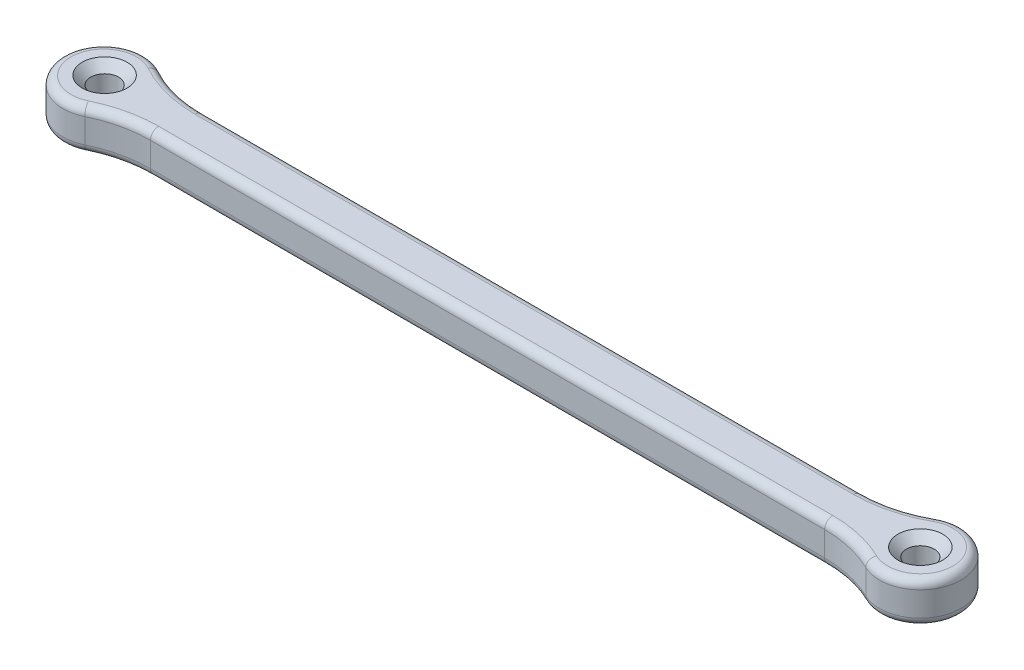
ISO-10303-21;
HEADER;
FILE_DESCRIPTION(('STEP AP214'),'2;1');
FILE_NAME('part.step','',(''),(''),'','','');
FILE_SCHEMA(('AUTOMOTIVE_DESIGN { 1 0 10303 214 1 1 1 1 }'));
ENDSEC;
DATA;
#1=APPLICATION_CONTEXT('core data for automotive mechanical design processes');
#2=APPLICATION_PROTOCOL_DEFINITION('international standard','automotive_design',2000,#1);
#3=PRODUCT_CONTEXT('',#1,'mechanical');
#4=PRODUCT('Part','Part','',(#3));
#5=PRODUCT_RELATED_PRODUCT_CATEGORY('part','',(#4));
#6=PRODUCT_DEFINITION_FORMATION('','',#4);
#7=PRODUCT_DEFINITION_CONTEXT('part definition',#1,'design');
#8=PRODUCT_DEFINITION('design','',#6,#7);
#9=PRODUCT_DEFINITION_SHAPE('','',#8);
#10=(LENGTH_UNIT() NAMED_UNIT(*) SI_UNIT(.MILLI.,.METRE.));
#11=(NAMED_UNIT(*) PLANE_ANGLE_UNIT() SI_UNIT($,.RADIAN.));
#12=(NAMED_UNIT(*) SI_UNIT($,.STERADIAN.) SOLID_ANGLE_UNIT());
#13=UNCERTAINTY_MEASURE_WITH_UNIT(LENGTH_MEASURE(1.E-05),#10,'distance_accuracy_value','');
#14=(GEOMETRIC_REPRESENTATION_CONTEXT(3) GLOBAL_UNCERTAINTY_ASSIGNED_CONTEXT((#13)) GLOBAL_UNIT_ASSIGNED_CONTEXT((#10,
#11,#12)) REPRESENTATION_CONTEXT('',''));
#15=CARTESIAN_POINT('',(0.,0.,0.));
#16=DIRECTION('',(0.,0.,1.));
#17=DIRECTION('',(1.,0.,0.));
#18=AXIS2_PLACEMENT_3D('',#15,#16,#17);
#19=CARTESIAN_POINT('',(90.3175416344814,5.,-17.5));
#20=DIRECTION('',(0.,-1.,0.));
#21=DIRECTION('',(0.,0.,-1.));
#22=AXIS2_PLACEMENT_3D('',#19,#20,#21);
#23=CYLINDRICAL_SURFACE('',#22,15.);
#24=DIRECTION('',(0.,-1.,0.));
#25=VECTOR('',#24,1.);
#26=CARTESIAN_POINT('',(97.5793854086204,5.,-4.37500000000002));
#27=LINE('',#26,#25);
#28=CARTESIAN_POINT('',(97.5793854086204,4.,-4.37500000000002));
#29=VERTEX_POINT('',#28);
#30=CARTESIAN_POINT('',(97.5793854086204,1.,-4.37500000000002));
#31=VERTEX_POINT('',#30);
#32=EDGE_CURVE('E155',#29,#31,#27,.T.);
#33=ORIENTED_EDGE('',*,*,#32,.T.);
#34=CARTESIAN_POINT('',(90.3175416344814,1.,-17.5));
#35=DIRECTION('',(0.,1.,0.));
#36=DIRECTION('',(0.,0.,1.));
#37=AXIS2_PLACEMENT_3D('',#34,#35,#36);
#38=CIRCLE('',#37,15.);
#39=CARTESIAN_POINT('',(90.3175416344814,1.,-2.5));
#40=VERTEX_POINT('',#39);
#41=EDGE_CURVE('E45',#31,#40,#38,.F.);
#42=ORIENTED_EDGE('',*,*,#41,.T.);
#43=DIRECTION('',(0.,-1.,0.));
#44=VECTOR('',#43,1.);
#45=CARTESIAN_POINT('',(90.3175416344814,5.,-2.5));
#46=LINE('',#45,#44);
#47=CARTESIAN_POINT('',(90.3175416344814,4.,-2.5));
#48=VERTEX_POINT('',#47);
#49=EDGE_CURVE('E188',#48,#40,#46,.T.);
#50=ORIENTED_EDGE('',*,*,#49,.F.);
#51=CARTESIAN_POINT('',(90.3175416344814,4.,-17.5));
#52=DIRECTION('',(0.,1.,0.));
#53=DIRECTION('',(0.,0.,1.));
#54=AXIS2_PLACEMENT_3D('',#51,#52,#53);
#55=CIRCLE('',#54,15.);
#56=EDGE_CURVE('E160',#48,#29,#55,.T.);
#57=ORIENTED_EDGE('',*,*,#56,.T.);
#58=EDGE_LOOP('',(#33,#42,#50,#57));
#59=FACE_BOUND('',#58,.T.);
#60=ADVANCED_FACE('F36',(#59),#23,.F.);
#61=CARTESIAN_POINT('',(9.68245836551854,5.,-2.5));
#62=DIRECTION('',(0.,0.,-1.));
#63=DIRECTION('',(-1.,0.,0.));
#64=AXIS2_PLACEMENT_3D('',#61,#62,#63);
#65=PLANE('',#64);
#66=ORIENTED_EDGE('',*,*,#49,.T.);
#67=DIRECTION('',(1.,0.,0.));
#68=VECTOR('',#67,1.);
#69=CARTESIAN_POINT('',(9.68245836551854,1.,-2.5));
#70=LINE('',#69,#68);
#71=CARTESIAN_POINT('',(9.68245836551854,1.,-2.5));
#72=VERTEX_POINT('',#71);
#73=EDGE_CURVE('E11',#40,#72,#70,.F.);
#74=ORIENTED_EDGE('',*,*,#73,.T.);
#75=DIRECTION('',(0.,-1.,0.));
#76=VECTOR('',#75,1.);
#77=CARTESIAN_POINT('',(9.68245836551854,5.,-2.5));
#78=LINE('',#77,#76);
#79=CARTESIAN_POINT('',(9.68245836551854,4.,-2.5));
#80=VERTEX_POINT('',#79);
#81=EDGE_CURVE('E192',#80,#72,#78,.T.);
#82=ORIENTED_EDGE('',*,*,#81,.F.);
#83=DIRECTION('',(1.,0.,0.));
#84=VECTOR('',#83,1.);
#85=CARTESIAN_POINT('',(9.68245836551854,4.,-2.5));
#86=LINE('',#85,#84);
#87=EDGE_CURVE('E208',#80,#48,#86,.T.);
#88=ORIENTED_EDGE('',*,*,#87,.T.);
#89=EDGE_LOOP('',(#66,#74,#82,#88));
#90=FACE_BOUND('',#89,.T.);
#91=ADVANCED_FACE('F307',(#90),#65,.T.);
#92=CARTESIAN_POINT('',(9.68245836551854,5.,-17.5));
#93=DIRECTION('',(0.,-1.,0.));
#94=DIRECTION('',(0.,0.,-1.));
#95=AXIS2_PLACEMENT_3D('',#92,#93,#94);
#96=CYLINDRICAL_SURFACE('',#95,15.);
#97=ORIENTED_EDGE('',*,*,#81,.T.);
#98=CARTESIAN_POINT('',(9.68245836551854,1.,-17.5));
#99=DIRECTION('',(0.,1.,0.));
#100=DIRECTION('',(0.,0.,1.));
#101=AXIS2_PLACEMENT_3D('',#98,#99,#100);
#102=CIRCLE('',#101,15.);
#103=CARTESIAN_POINT('',(2.42061459137963,1.,-4.37500000000001));
#104=VERTEX_POINT('',#103);
#105=EDGE_CURVE('E252',#72,#104,#102,.F.);
#106=ORIENTED_EDGE('',*,*,#105,.T.);
#107=DIRECTION('',(0.,-1.,0.));
#108=VECTOR('',#107,1.);
#109=CARTESIAN_POINT('',(2.42061459137963,5.,-4.37500000000001));
#110=LINE('',#109,#108);
#111=CARTESIAN_POINT('',(2.42061459137963,4.,-4.37500000000001));
#112=VERTEX_POINT('',#111);
#113=EDGE_CURVE('E315',#112,#104,#110,.T.);
#114=ORIENTED_EDGE('',*,*,#113,.F.);
#115=CARTESIAN_POINT('',(9.68245836551854,4.,-17.5));
#116=DIRECTION('',(0.,1.,0.));
#117=DIRECTION('',(0.,0.,1.));
#118=AXIS2_PLACEMENT_3D('',#115,#116,#117);
#119=CIRCLE('',#118,15.);
#120=EDGE_CURVE('E210',#112,#80,#119,.T.);
#121=ORIENTED_EDGE('',*,*,#120,.T.);
#122=EDGE_LOOP('',(#97,#106,#114,#121));
#123=FACE_BOUND('',#122,.T.);
#124=ADVANCED_FACE('F311',(#123),#96,.F.);
#125=CARTESIAN_POINT('',(0.,5.,0.));
#126=DIRECTION('',(0.,-1.,0.));
#127=DIRECTION('',(0.,0.,-1.));
#128=AXIS2_PLACEMENT_3D('',#125,#126,#127);
#129=CYLINDRICAL_SURFACE('',#128,5.);
#130=ORIENTED_EDGE('',*,*,#113,.T.);
#131=CARTESIAN_POINT('',(0.,1.,0.));
#132=DIRECTION('',(0.,1.,0.));
#133=DIRECTION('',(0.,0.,1.));
#134=AXIS2_PLACEMENT_3D('',#131,#132,#133);
#135=CIRCLE('',#134,5.);
#136=CARTESIAN_POINT('',(2.17944947177033,1.,4.5));
#137=VERTEX_POINT('',#136);
#138=EDGE_CURVE('E255',#104,#137,#135,.T.);
#139=ORIENTED_EDGE('',*,*,#138,.T.);
#140=DIRECTION('',(0.,-1.,0.));
#141=VECTOR('',#140,1.);
#142=CARTESIAN_POINT('',(2.17944947177033,5.,4.5));
#143=LINE('',#142,#141);
#144=CARTESIAN_POINT('',(2.17944947177033,4.,4.5));
#145=VERTEX_POINT('',#144);
#146=EDGE_CURVE('E330',#145,#137,#143,.T.);
#147=ORIENTED_EDGE('',*,*,#146,.F.);
#148=CARTESIAN_POINT('',(0.,4.,0.));
#149=DIRECTION('',(0.,1.,0.));
#150=DIRECTION('',(0.,0.,1.));
#151=AXIS2_PLACEMENT_3D('',#148,#149,#150);
#152=CIRCLE('',#151,5.);
#153=EDGE_CURVE('E212',#145,#112,#152,.F.);
#154=ORIENTED_EDGE('',*,*,#153,.T.);
#155=EDGE_LOOP('',(#130,#139,#147,#154));
#156=FACE_BOUND('',#155,.T.);
#157=ADVANCED_FACE('F329',(#156),#129,.T.);
#158=CARTESIAN_POINT('',(8.71779788708135,5.,18.));
#159=DIRECTION('',(0.,-1.,0.));
#160=DIRECTION('',(0.,0.,-1.));
#161=AXIS2_PLACEMENT_3D('',#158,#159,#160);
#162=CYLINDRICAL_SURFACE('',#161,15.);
#163=ORIENTED_EDGE('',*,*,#146,.T.);
#164=CARTESIAN_POINT('',(8.71779788708135,1.,18.));
#165=DIRECTION('',(0.,1.,0.));
#166=DIRECTION('',(0.,0.,1.));
#167=AXIS2_PLACEMENT_3D('',#164,#165,#166);
#168=CIRCLE('',#167,15.);
#169=CARTESIAN_POINT('',(8.71779788708135,1.,3.));
#170=VERTEX_POINT('',#169);
#171=EDGE_CURVE('E257',#137,#170,#168,.F.);
#172=ORIENTED_EDGE('',*,*,#171,.T.);
#173=DIRECTION('',(0.,-1.,0.));
#174=VECTOR('',#173,1.);
#175=CARTESIAN_POINT('',(8.71779788708135,5.,3.));
#176=LINE('',#175,#174);
#177=CARTESIAN_POINT('',(8.71779788708135,4.,3.));
#178=VERTEX_POINT('',#177);
#179=EDGE_CURVE('E338',#178,#170,#176,.T.);
#180=ORIENTED_EDGE('',*,*,#179,.F.);
#181=CARTESIAN_POINT('',(8.71779788708135,4.,18.));
#182=DIRECTION('',(0.,1.,0.));
#183=DIRECTION('',(0.,0.,1.));
#184=AXIS2_PLACEMENT_3D('',#181,#182,#183);
#185=CIRCLE('',#184,15.);
#186=EDGE_CURVE('E214',#178,#145,#185,.T.);
#187=ORIENTED_EDGE('',*,*,#186,.T.);
#188=EDGE_LOOP('',(#163,#172,#180,#187));
#189=FACE_BOUND('',#188,.T.);
#190=ADVANCED_FACE('F334',(#189),#162,.F.);
#191=CARTESIAN_POINT('',(91.2822021129186,5.,3.));
#192=DIRECTION('',(0.,0.,1.));
#193=DIRECTION('',(1.,0.,0.));
#194=AXIS2_PLACEMENT_3D('',#191,#192,#193);
#195=PLANE('',#194);
#196=ORIENTED_EDGE('',*,*,#179,.T.);
#197=DIRECTION('',(-1.,0.,0.));
#198=VECTOR('',#197,1.);
#199=CARTESIAN_POINT('',(91.2822021129186,1.,3.));
#200=LINE('',#199,#198);
#201=CARTESIAN_POINT('',(91.2822021129186,1.,3.));
#202=VERTEX_POINT('',#201);
#203=EDGE_CURVE('E259',#170,#202,#200,.F.);
#204=ORIENTED_EDGE('',*,*,#203,.T.);
#205=DIRECTION('',(0.,-1.,0.));
#206=VECTOR('',#205,1.);
#207=CARTESIAN_POINT('',(91.2822021129186,5.,3.));
#208=LINE('',#207,#206);
#209=CARTESIAN_POINT('',(91.2822021129186,4.,3.));
#210=VERTEX_POINT('',#209);
#211=EDGE_CURVE('E172',#210,#202,#208,.T.);
#212=ORIENTED_EDGE('',*,*,#211,.F.);
#213=DIRECTION('',(-1.,0.,0.));
#214=VECTOR('',#213,1.);
#215=CARTESIAN_POINT('',(91.2822021129186,4.,3.));
#216=LINE('',#215,#214);
#217=EDGE_CURVE('E216',#210,#178,#216,.T.);
#218=ORIENTED_EDGE('',*,*,#217,.T.);
#219=EDGE_LOOP('',(#196,#204,#212,#218));
#220=FACE_BOUND('',#219,.T.);
#221=ADVANCED_FACE('F429',(#220),#195,.T.);
#222=CARTESIAN_POINT('',(91.2822021129186,5.,18.));
#223=DIRECTION('',(0.,-1.,0.));
#224=DIRECTION('',(0.,0.,-1.));
#225=AXIS2_PLACEMENT_3D('',#222,#223,#224);
#226=CYLINDRICAL_SURFACE('',#225,15.);
#227=ORIENTED_EDGE('',*,*,#211,.T.);
#228=CARTESIAN_POINT('',(91.2822021129186,1.,18.));
#229=DIRECTION('',(0.,1.,0.));
#230=DIRECTION('',(0.,0.,1.));
#231=AXIS2_PLACEMENT_3D('',#228,#229,#230);
#232=CIRCLE('',#231,15.);
#233=CARTESIAN_POINT('',(97.8205505282296,1.,4.5));
#234=VERTEX_POINT('',#233);
#235=EDGE_CURVE('E171',#202,#234,#232,.F.);
#236=ORIENTED_EDGE('',*,*,#235,.T.);
#237=DIRECTION('',(0.,-1.,0.));
#238=VECTOR('',#237,1.);
#239=CARTESIAN_POINT('',(97.8205505282296,5.,4.5));
#240=LINE('',#239,#238);
#241=CARTESIAN_POINT('',(97.8205505282296,4.,4.5));
#242=VERTEX_POINT('',#241);
#243=EDGE_CURVE('E153',#242,#234,#240,.T.);
#244=ORIENTED_EDGE('',*,*,#243,.F.);
#245=CARTESIAN_POINT('',(91.2822021129186,4.,18.));
#246=DIRECTION('',(0.,1.,0.));
#247=DIRECTION('',(0.,0.,1.));
#248=AXIS2_PLACEMENT_3D('',#245,#246,#247);
#249=CIRCLE('',#248,15.);
#250=EDGE_CURVE('E168',#242,#210,#249,.T.);
#251=ORIENTED_EDGE('',*,*,#250,.T.);
#252=EDGE_LOOP('',(#227,#236,#244,#251));
#253=FACE_BOUND('',#252,.T.);
#254=ADVANCED_FACE('F166',(#253),#226,.F.);
#255=CARTESIAN_POINT('',(100.,5.,0.));
#256=DIRECTION('',(0.,-1.,0.));
#257=DIRECTION('',(0.,0.,-1.));
#258=AXIS2_PLACEMENT_3D('',#255,#256,#257);
#259=CYLINDRICAL_SURFACE('',#258,5.00000000000001);
#260=ORIENTED_EDGE('',*,*,#243,.T.);
#261=CARTESIAN_POINT('',(100.,1.,0.));
#262=DIRECTION('',(0.,1.,0.));
#263=DIRECTION('',(0.,0.,1.));
#264=AXIS2_PLACEMENT_3D('',#261,#262,#263);
#265=CIRCLE('',#264,5.00000000000001);
#266=EDGE_CURVE('E60',#234,#31,#265,.T.);
#267=ORIENTED_EDGE('',*,*,#266,.T.);
#268=ORIENTED_EDGE('',*,*,#32,.F.);
#269=CARTESIAN_POINT('',(100.,4.,0.));
#270=DIRECTION('',(0.,1.,0.));
#271=DIRECTION('',(0.,0.,1.));
#272=AXIS2_PLACEMENT_3D('',#269,#270,#271);
#273=CIRCLE('',#272,5.00000000000001);
#274=EDGE_CURVE('E150',#29,#242,#273,.F.);
#275=ORIENTED_EDGE('',*,*,#274,.T.);
#276=EDGE_LOOP('',(#260,#267,#268,#275));
#277=FACE_BOUND('',#276,.T.);
#278=ADVANCED_FACE('F152',(#277),#259,.T.);
#279=CARTESIAN_POINT('',(90.3175416344814,5.,-17.5));
#280=DIRECTION('',(0.,1.,0.));
#281=DIRECTION('',(0.,0.,1.));
#282=AXIS2_PLACEMENT_3D('',#279,#280,#281);
#283=PLANE('',#282);
#284=CARTESIAN_POINT('',(100.,5.,0.));
#285=DIRECTION('',(0.,1.,0.));
#286=DIRECTION('',(0.,0.,1.));
#287=AXIS2_PLACEMENT_3D('',#284,#285,#286);
#288=CIRCLE('',#287,2.75);
#289=CARTESIAN_POINT('',(100.,5.,2.75));
#290=VERTEX_POINT('',#289);
#291=EDGE_CURVE('E513',#290,#290,#288,.T.);
#292=ORIENTED_EDGE('',*,*,#291,.F.);
#293=EDGE_LOOP('',(#292));
#294=FACE_BOUND('',#293,.T.);
#295=CARTESIAN_POINT('',(0.,5.,-0.108654030696453));
#296=DIRECTION('',(0.,1.,0.));
#297=DIRECTION('',(0.,0.,1.));
#298=AXIS2_PLACEMENT_3D('',#295,#296,#297);
#299=CIRCLE('',#298,2.75);
#300=CARTESIAN_POINT('',(0.,5.,2.64134596930355));
#301=VERTEX_POINT('',#300);
#302=EDGE_CURVE('E486',#301,#301,#299,.T.);
#303=ORIENTED_EDGE('',*,*,#302,.F.);
#304=EDGE_LOOP('',(#303));
#305=FACE_BOUND('',#304,.T.);
#306=DIRECTION('',(-1.,0.,0.));
#307=VECTOR('',#306,1.);
#308=CARTESIAN_POINT('',(90.3175416344814,5.,2.));
#309=LINE('',#308,#307);
#310=CARTESIAN_POINT('',(8.71779788708135,5.,2.));
#311=VERTEX_POINT('',#310);
#312=CARTESIAN_POINT('',(91.2822021129186,5.,2.));
#313=VERTEX_POINT('',#312);
#314=EDGE_CURVE('E187',#311,#313,#309,.F.);
#315=ORIENTED_EDGE('',*,*,#314,.T.);
#316=CARTESIAN_POINT('',(91.2822021129186,5.,18.));
#317=DIRECTION('',(0.,1.,0.));
#318=DIRECTION('',(0.,0.,1.));
#319=AXIS2_PLACEMENT_3D('',#316,#317,#318);
#320=CIRCLE('',#319,16.);
#321=CARTESIAN_POINT('',(98.2564404225837,5.,3.59999999999998));
#322=VERTEX_POINT('',#321);
#323=EDGE_CURVE('E161',#313,#322,#320,.F.);
#324=ORIENTED_EDGE('',*,*,#323,.T.);
#325=CARTESIAN_POINT('',(100.,5.,0.));
#326=DIRECTION('',(0.,1.,0.));
#327=DIRECTION('',(0.,0.,1.));
#328=AXIS2_PLACEMENT_3D('',#325,#326,#327);
#329=CIRCLE('',#328,4.00000000000001);
#330=CARTESIAN_POINT('',(98.0635083268963,5.,-3.50000000000002));
#331=VERTEX_POINT('',#330);
#332=EDGE_CURVE('E177',#322,#331,#329,.T.);
#333=ORIENTED_EDGE('',*,*,#332,.T.);
#334=CARTESIAN_POINT('',(90.3175416344814,5.,-17.5));
#335=DIRECTION('',(0.,1.,0.));
#336=DIRECTION('',(0.,0.,1.));
#337=AXIS2_PLACEMENT_3D('',#334,#335,#336);
#338=CIRCLE('',#337,16.);
#339=CARTESIAN_POINT('',(90.3175416344814,5.,-1.5));
#340=VERTEX_POINT('',#339);
#341=EDGE_CURVE('E203',#331,#340,#338,.F.);
#342=ORIENTED_EDGE('',*,*,#341,.T.);
#343=DIRECTION('',(1.,0.,0.));
#344=VECTOR('',#343,1.);
#345=CARTESIAN_POINT('',(90.3175416344814,5.,-1.5));
#346=LINE('',#345,#344);
#347=CARTESIAN_POINT('',(9.68245836551854,5.,-1.5));
#348=VERTEX_POINT('',#347);
#349=EDGE_CURVE('E201',#340,#348,#346,.F.);
#350=ORIENTED_EDGE('',*,*,#349,.T.);
#351=CARTESIAN_POINT('',(9.68245836551854,5.,-17.5));
#352=DIRECTION('',(0.,1.,0.));
#353=DIRECTION('',(0.,0.,1.));
#354=AXIS2_PLACEMENT_3D('',#351,#352,#353);
#355=CIRCLE('',#354,16.);
#356=CARTESIAN_POINT('',(1.9364916731037,5.,-3.5));
#357=VERTEX_POINT('',#356);
#358=EDGE_CURVE('E199',#348,#357,#355,.F.);
#359=ORIENTED_EDGE('',*,*,#358,.T.);
#360=CARTESIAN_POINT('',(0.,5.,0.));
#361=DIRECTION('',(0.,1.,0.));
#362=DIRECTION('',(0.,0.,1.));
#363=AXIS2_PLACEMENT_3D('',#360,#361,#362);
#364=CIRCLE('',#363,4.);
#365=CARTESIAN_POINT('',(1.74355957741626,5.,3.6));
#366=VERTEX_POINT('',#365);
#367=EDGE_CURVE('E197',#357,#366,#364,.T.);
#368=ORIENTED_EDGE('',*,*,#367,.T.);
#369=CARTESIAN_POINT('',(8.71779788708135,5.,18.));
#370=DIRECTION('',(0.,1.,0.));
#371=DIRECTION('',(0.,0.,1.));
#372=AXIS2_PLACEMENT_3D('',#369,#370,#371);
#373=CIRCLE('',#372,16.);
#374=EDGE_CURVE('E190',#366,#311,#373,.F.);
#375=ORIENTED_EDGE('',*,*,#374,.T.);
#376=EDGE_LOOP('',(#315,#324,#333,#342,#350,#359,#368,#375));
#377=FACE_BOUND('',#376,.T.);
#378=ADVANCED_FACE('F347',(#294,#305,#377),#283,.T.);
#379=CARTESIAN_POINT('',(90.3175416344814,0.,-17.5));
#380=DIRECTION('',(0.,1.,0.));
#381=DIRECTION('',(0.,0.,1.));
#382=AXIS2_PLACEMENT_3D('',#379,#380,#381);
#383=PLANE('',#382);
#384=CARTESIAN_POINT('',(100.,0.,0.));
#385=DIRECTION('',(0.,1.,0.));
#386=DIRECTION('',(0.,0.,1.));
#387=AXIS2_PLACEMENT_3D('',#384,#385,#386);
#388=CIRCLE('',#387,1.69999999999999);
#389=CARTESIAN_POINT('',(100.,0.,1.69999999999999));
#390=VERTEX_POINT('',#389);
#391=EDGE_CURVE('E490',#390,#390,#388,.T.);
#392=ORIENTED_EDGE('',*,*,#391,.T.);
#393=EDGE_LOOP('',(#392));
#394=FACE_BOUND('',#393,.T.);
#395=CARTESIAN_POINT('',(0.,0.,-0.108654030696453));
#396=DIRECTION('',(0.,1.,0.));
#397=DIRECTION('',(0.,0.,1.));
#398=AXIS2_PLACEMENT_3D('',#395,#396,#397);
#399=CIRCLE('',#398,1.7);
#400=CARTESIAN_POINT('',(0.,0.,1.59134596930355));
#401=VERTEX_POINT('',#400);
#402=EDGE_CURVE('E267',#401,#401,#399,.T.);
#403=ORIENTED_EDGE('',*,*,#402,.T.);
#404=EDGE_LOOP('',(#403));
#405=FACE_BOUND('',#404,.T.);
#406=CARTESIAN_POINT('',(0.,0.,0.));
#407=DIRECTION('',(0.,1.,0.));
#408=DIRECTION('',(0.,0.,1.));
#409=AXIS2_PLACEMENT_3D('',#406,#407,#408);
#410=CIRCLE('',#409,4.);
#411=CARTESIAN_POINT('',(1.74355957741626,0.,3.6));
#412=VERTEX_POINT('',#411);
#413=CARTESIAN_POINT('',(1.9364916731037,0.,-3.5));
#414=VERTEX_POINT('',#413);
#415=EDGE_CURVE('E247',#412,#414,#410,.F.);
#416=ORIENTED_EDGE('',*,*,#415,.T.);
#417=CARTESIAN_POINT('',(9.68245836551854,0.,-17.5));
#418=DIRECTION('',(0.,1.,0.));
#419=DIRECTION('',(0.,0.,1.));
#420=AXIS2_PLACEMENT_3D('',#417,#418,#419);
#421=CIRCLE('',#420,16.);
#422=CARTESIAN_POINT('',(9.68245836551854,0.,-1.5));
#423=VERTEX_POINT('',#422);
#424=EDGE_CURVE('E249',#414,#423,#421,.T.);
#425=ORIENTED_EDGE('',*,*,#424,.T.);
#426=DIRECTION('',(1.,0.,0.));
#427=VECTOR('',#426,1.);
#428=CARTESIAN_POINT('',(90.3175416344814,0.,-1.5));
#429=LINE('',#428,#427);
#430=CARTESIAN_POINT('',(90.3175416344814,0.,-1.5));
#431=VERTEX_POINT('',#430);
#432=EDGE_CURVE('E218',#423,#431,#429,.T.);
#433=ORIENTED_EDGE('',*,*,#432,.T.);
#434=CARTESIAN_POINT('',(90.3175416344814,0.,-17.5));
#435=DIRECTION('',(0.,1.,0.));
#436=DIRECTION('',(0.,0.,1.));
#437=AXIS2_PLACEMENT_3D('',#434,#435,#436);
#438=CIRCLE('',#437,16.);
#439=CARTESIAN_POINT('',(98.0635083268963,0.,-3.50000000000002));
#440=VERTEX_POINT('',#439);
#441=EDGE_CURVE('E237',#431,#440,#438,.T.);
#442=ORIENTED_EDGE('',*,*,#441,.T.);
#443=CARTESIAN_POINT('',(100.,0.,0.));
#444=DIRECTION('',(0.,1.,0.));
#445=DIRECTION('',(0.,0.,1.));
#446=AXIS2_PLACEMENT_3D('',#443,#444,#445);
#447=CIRCLE('',#446,4.00000000000001);
#448=CARTESIAN_POINT('',(98.2564404225837,0.,3.59999999999998));
#449=VERTEX_POINT('',#448);
#450=EDGE_CURVE('E239',#440,#449,#447,.F.);
#451=ORIENTED_EDGE('',*,*,#450,.T.);
#452=CARTESIAN_POINT('',(91.2822021129186,0.,18.));
#453=DIRECTION('',(0.,1.,0.));
#454=DIRECTION('',(0.,0.,1.));
#455=AXIS2_PLACEMENT_3D('',#452,#453,#454);
#456=CIRCLE('',#455,16.);
#457=CARTESIAN_POINT('',(91.2822021129186,0.,2.));
#458=VERTEX_POINT('',#457);
#459=EDGE_CURVE('E241',#449,#458,#456,.T.);
#460=ORIENTED_EDGE('',*,*,#459,.T.);
#461=DIRECTION('',(-1.,0.,0.));
#462=VECTOR('',#461,1.);
#463=CARTESIAN_POINT('',(8.71779788708135,0.,2.));
#464=LINE('',#463,#462);
#465=CARTESIAN_POINT('',(8.71779788708135,0.,2.));
#466=VERTEX_POINT('',#465);
#467=EDGE_CURVE('E243',#458,#466,#464,.T.);
#468=ORIENTED_EDGE('',*,*,#467,.T.);
#469=CARTESIAN_POINT('',(8.71779788708135,0.,18.));
#470=DIRECTION('',(0.,1.,0.));
#471=DIRECTION('',(0.,0.,1.));
#472=AXIS2_PLACEMENT_3D('',#469,#470,#471);
#473=CIRCLE('',#472,16.);
#474=EDGE_CURVE('E245',#466,#412,#473,.T.);
#475=ORIENTED_EDGE('',*,*,#474,.T.);
#476=EDGE_LOOP('',(#416,#425,#433,#442,#451,#460,#468,#475));
#477=FACE_BOUND('',#476,.T.);
#478=ADVANCED_FACE('F344',(#394,#405,#477),#383,.F.);
#479=CARTESIAN_POINT('',(9.68245836551854,4.,-17.5));
#480=DIRECTION('',(0.,1.,0.));
#481=DIRECTION('',(0.,0.,1.));
#482=AXIS2_PLACEMENT_3D('',#479,#480,#481);
#483=TOROIDAL_SURFACE('',#482,16.,1.);
#484=CARTESIAN_POINT('',(1.9364916731037,4.,-3.50000000000001));
#485=DIRECTION('',(-0.875,0.,-0.484122918275927));
#486=DIRECTION('',(-0.484122918275927,0.,0.875));
#487=AXIS2_PLACEMENT_3D('',#484,#485,#486);
#488=CIRCLE('',#487,1.);
#489=EDGE_CURVE('E230',#357,#112,#488,.T.);
#490=ORIENTED_EDGE('',*,*,#489,.F.);
#491=ORIENTED_EDGE('',*,*,#358,.F.);
#492=CARTESIAN_POINT('',(9.68245836551854,4.,-1.5));
#493=DIRECTION('',(1.,0.,0.));
#494=DIRECTION('',(0.,0.,-1.));
#495=AXIS2_PLACEMENT_3D('',#492,#493,#494);
#496=CIRCLE('',#495,1.);
#497=EDGE_CURVE('E233',#80,#348,#496,.T.);
#498=ORIENTED_EDGE('',*,*,#497,.F.);
#499=ORIENTED_EDGE('',*,*,#120,.F.);
#500=EDGE_LOOP('',(#490,#491,#498,#499));
#501=FACE_BOUND('',#500,.T.);
#502=ADVANCED_FACE('F346',(#501),#483,.T.);
#503=CARTESIAN_POINT('',(9.68245836551854,4.,-1.5));
#504=DIRECTION('',(1.,0.,0.));
#505=DIRECTION('',(0.,0.,-1.));
#506=AXIS2_PLACEMENT_3D('',#503,#504,#505);
#507=CYLINDRICAL_SURFACE('',#506,1.);
#508=ORIENTED_EDGE('',*,*,#497,.T.);
#509=ORIENTED_EDGE('',*,*,#349,.F.);
#510=CARTESIAN_POINT('',(90.3175416344814,4.,-1.5));
#511=DIRECTION('',(1.,0.,0.));
#512=DIRECTION('',(0.,0.,-1.));
#513=AXIS2_PLACEMENT_3D('',#510,#511,#512);
#514=CIRCLE('',#513,1.);
#515=EDGE_CURVE('E227',#48,#340,#514,.T.);
#516=ORIENTED_EDGE('',*,*,#515,.F.);
#517=ORIENTED_EDGE('',*,*,#87,.F.);
#518=EDGE_LOOP('',(#508,#509,#516,#517));
#519=FACE_BOUND('',#518,.T.);
#520=ADVANCED_FACE('F353',(#519),#507,.T.);
#521=CARTESIAN_POINT('',(0.,4.,0.));
#522=DIRECTION('',(0.,1.,0.));
#523=DIRECTION('',(0.,0.,1.));
#524=AXIS2_PLACEMENT_3D('',#521,#522,#523);
#525=TOROIDAL_SURFACE('',#524,4.,1.);
#526=ORIENTED_EDGE('',*,*,#489,.T.);
#527=ORIENTED_EDGE('',*,*,#153,.F.);
#528=CARTESIAN_POINT('',(1.74355957741626,4.,3.6));
#529=DIRECTION('',(0.900000000000001,0.,-0.435889894354066));
#530=DIRECTION('',(-0.435889894354066,0.,-0.900000000000001));
#531=AXIS2_PLACEMENT_3D('',#528,#529,#530);
#532=CIRCLE('',#531,1.);
#533=EDGE_CURVE('E224',#366,#145,#532,.T.);
#534=ORIENTED_EDGE('',*,*,#533,.F.);
#535=ORIENTED_EDGE('',*,*,#367,.F.);
#536=EDGE_LOOP('',(#526,#527,#534,#535));
#537=FACE_BOUND('',#536,.T.);
#538=ADVANCED_FACE('F385',(#537),#525,.T.);
#539=CARTESIAN_POINT('',(90.3175416344814,4.,-17.5));
#540=DIRECTION('',(0.,1.,0.));
#541=DIRECTION('',(0.,0.,1.));
#542=AXIS2_PLACEMENT_3D('',#539,#540,#541);
#543=TOROIDAL_SURFACE('',#542,16.,1.);
#544=ORIENTED_EDGE('',*,*,#515,.T.);
#545=ORIENTED_EDGE('',*,*,#341,.F.);
#546=CARTESIAN_POINT('',(98.0635083268963,4.,-3.50000000000002));
#547=DIRECTION('',(0.874999999999998,0.,-0.484122918275931));
#548=DIRECTION('',(-0.484122918275931,0.,-0.874999999999998));
#549=AXIS2_PLACEMENT_3D('',#546,#547,#548);
#550=CIRCLE('',#549,1.);
#551=EDGE_CURVE('E222',#29,#331,#550,.T.);
#552=ORIENTED_EDGE('',*,*,#551,.F.);
#553=ORIENTED_EDGE('',*,*,#56,.F.);
#554=EDGE_LOOP('',(#544,#545,#552,#553));
#555=FACE_BOUND('',#554,.T.);
#556=ADVANCED_FACE('F381',(#555),#543,.T.);
#557=CARTESIAN_POINT('',(8.71779788708135,4.,18.));
#558=DIRECTION('',(0.,1.,0.));
#559=DIRECTION('',(0.,0.,1.));
#560=AXIS2_PLACEMENT_3D('',#557,#558,#559);
#561=TOROIDAL_SURFACE('',#560,16.,1.);
#562=ORIENTED_EDGE('',*,*,#533,.T.);
#563=ORIENTED_EDGE('',*,*,#186,.F.);
#564=CARTESIAN_POINT('',(8.71779788708135,4.,2.));
#565=DIRECTION('',(1.,0.,0.));
#566=DIRECTION('',(0.,0.,-1.));
#567=AXIS2_PLACEMENT_3D('',#564,#565,#566);
#568=CIRCLE('',#567,1.);
#569=EDGE_CURVE('E181',#311,#178,#568,.T.);
#570=ORIENTED_EDGE('',*,*,#569,.F.);
#571=ORIENTED_EDGE('',*,*,#374,.F.);
#572=EDGE_LOOP('',(#562,#563,#570,#571));
#573=FACE_BOUND('',#572,.T.);
#574=ADVANCED_FACE('F378',(#573),#561,.T.);
#575=CARTESIAN_POINT('',(100.,4.,0.));
#576=DIRECTION('',(0.,1.,0.));
#577=DIRECTION('',(0.,0.,1.));
#578=AXIS2_PLACEMENT_3D('',#575,#576,#577);
#579=TOROIDAL_SURFACE('',#578,4.00000000000001,1.);
#580=ORIENTED_EDGE('',*,*,#551,.T.);
#581=ORIENTED_EDGE('',*,*,#332,.F.);
#582=CARTESIAN_POINT('',(98.2564404225837,4.,3.59999999999999));
#583=DIRECTION('',(-0.899999999999997,0.,-0.435889894354073));
#584=DIRECTION('',(-0.435889894354073,0.,0.899999999999997));
#585=AXIS2_PLACEMENT_3D('',#582,#583,#584);
#586=CIRCLE('',#585,1.);
#587=EDGE_CURVE('E175',#242,#322,#586,.T.);
#588=ORIENTED_EDGE('',*,*,#587,.F.);
#589=ORIENTED_EDGE('',*,*,#274,.F.);
#590=EDGE_LOOP('',(#580,#581,#588,#589));
#591=FACE_BOUND('',#590,.T.);
#592=ADVANCED_FACE('F176',(#591),#579,.T.);
#593=CARTESIAN_POINT('',(91.2822021129186,4.,2.));
#594=DIRECTION('',(-1.,0.,0.));
#595=DIRECTION('',(0.,0.,1.));
#596=AXIS2_PLACEMENT_3D('',#593,#594,#595);
#597=CYLINDRICAL_SURFACE('',#596,1.);
#598=ORIENTED_EDGE('',*,*,#569,.T.);
#599=ORIENTED_EDGE('',*,*,#217,.F.);
#600=CARTESIAN_POINT('',(91.2822021129186,4.,2.));
#601=DIRECTION('',(1.,0.,0.));
#602=DIRECTION('',(0.,0.,-1.));
#603=AXIS2_PLACEMENT_3D('',#600,#601,#602);
#604=CIRCLE('',#603,1.);
#605=EDGE_CURVE('E182',#313,#210,#604,.T.);
#606=ORIENTED_EDGE('',*,*,#605,.F.);
#607=ORIENTED_EDGE('',*,*,#314,.F.);
#608=EDGE_LOOP('',(#598,#599,#606,#607));
#609=FACE_BOUND('',#608,.T.);
#610=ADVANCED_FACE('F372',(#609),#597,.T.);
#611=CARTESIAN_POINT('',(91.2822021129186,4.,18.));
#612=DIRECTION('',(0.,1.,0.));
#613=DIRECTION('',(0.,0.,1.));
#614=AXIS2_PLACEMENT_3D('',#611,#612,#613);
#615=TOROIDAL_SURFACE('',#614,16.,1.);
#616=ORIENTED_EDGE('',*,*,#587,.T.);
#617=ORIENTED_EDGE('',*,*,#323,.F.);
#618=ORIENTED_EDGE('',*,*,#605,.T.);
#619=ORIENTED_EDGE('',*,*,#250,.F.);
#620=EDGE_LOOP('',(#616,#617,#618,#619));
#621=FACE_BOUND('',#620,.T.);
#622=ADVANCED_FACE('F184',(#621),#615,.T.);
#623=CARTESIAN_POINT('',(91.2822021129186,1.,18.));
#624=DIRECTION('',(0.,1.,0.));
#625=DIRECTION('',(0.,0.,1.));
#626=AXIS2_PLACEMENT_3D('',#623,#624,#625);
#627=TOROIDAL_SURFACE('',#626,16.,1.);
#628=CARTESIAN_POINT('',(98.2564404225837,1.,3.6));
#629=DIRECTION('',(0.899999999999998,0.,0.435889894354071));
#630=DIRECTION('',(0.435889894354071,0.,-0.899999999999998));
#631=AXIS2_PLACEMENT_3D('',#628,#629,#630);
#632=CIRCLE('',#631,1.);
#633=EDGE_CURVE('E280',#234,#449,#632,.T.);
#634=ORIENTED_EDGE('',*,*,#633,.F.);
#635=ORIENTED_EDGE('',*,*,#235,.F.);
#636=CARTESIAN_POINT('',(91.2822021129186,1.,2.));
#637=DIRECTION('',(-1.,0.,0.));
#638=DIRECTION('',(0.,0.,1.));
#639=AXIS2_PLACEMENT_3D('',#636,#637,#638);
#640=CIRCLE('',#639,1.);
#641=EDGE_CURVE('E40',#458,#202,#640,.T.);
#642=ORIENTED_EDGE('',*,*,#641,.F.);
#643=ORIENTED_EDGE('',*,*,#459,.F.);
#644=EDGE_LOOP('',(#634,#635,#642,#643));
#645=FACE_BOUND('',#644,.T.);
#646=ADVANCED_FACE('F38',(#645),#627,.T.);
#647=CARTESIAN_POINT('',(90.3175416344814,1.,2.));
#648=DIRECTION('',(1.,0.,0.));
#649=DIRECTION('',(0.,0.,-1.));
#650=AXIS2_PLACEMENT_3D('',#647,#648,#649);
#651=CYLINDRICAL_SURFACE('',#650,1.);
#652=ORIENTED_EDGE('',*,*,#641,.T.);
#653=ORIENTED_EDGE('',*,*,#203,.F.);
#654=CARTESIAN_POINT('',(8.71779788708135,1.,2.));
#655=DIRECTION('',(-1.,0.,0.));
#656=DIRECTION('',(0.,0.,1.));
#657=AXIS2_PLACEMENT_3D('',#654,#655,#656);
#658=CIRCLE('',#657,1.);
#659=EDGE_CURVE('E278',#466,#170,#658,.T.);
#660=ORIENTED_EDGE('',*,*,#659,.F.);
#661=ORIENTED_EDGE('',*,*,#467,.F.);
#662=EDGE_LOOP('',(#652,#653,#660,#661));
#663=FACE_BOUND('',#662,.T.);
#664=ADVANCED_FACE('F289',(#663),#651,.T.);
#665=CARTESIAN_POINT('',(100.,1.,0.));
#666=DIRECTION('',(0.,1.,0.));
#667=DIRECTION('',(0.,0.,1.));
#668=AXIS2_PLACEMENT_3D('',#665,#666,#667);
#669=TOROIDAL_SURFACE('',#668,4.00000000000001,1.);
#670=ORIENTED_EDGE('',*,*,#633,.T.);
#671=ORIENTED_EDGE('',*,*,#450,.F.);
#672=CARTESIAN_POINT('',(98.0635083268963,1.,-3.50000000000001));
#673=DIRECTION('',(-0.874999999999999,0.,0.484122918275929));
#674=DIRECTION('',(0.484122918275929,0.,0.874999999999999));
#675=AXIS2_PLACEMENT_3D('',#672,#673,#674);
#676=CIRCLE('',#675,1.);
#677=EDGE_CURVE('E275',#31,#440,#676,.T.);
#678=ORIENTED_EDGE('',*,*,#677,.F.);
#679=ORIENTED_EDGE('',*,*,#266,.F.);
#680=EDGE_LOOP('',(#670,#671,#678,#679));
#681=FACE_BOUND('',#680,.T.);
#682=ADVANCED_FACE('F294',(#681),#669,.T.);
#683=CARTESIAN_POINT('',(8.71779788708135,1.,18.));
#684=DIRECTION('',(0.,1.,0.));
#685=DIRECTION('',(0.,0.,1.));
#686=AXIS2_PLACEMENT_3D('',#683,#684,#685);
#687=TOROIDAL_SURFACE('',#686,16.,1.);
#688=ORIENTED_EDGE('',*,*,#659,.T.);
#689=ORIENTED_EDGE('',*,*,#171,.F.);
#690=CARTESIAN_POINT('',(1.74355957741626,1.,3.6));
#691=DIRECTION('',(-0.900000000000001,0.,0.435889894354066));
#692=DIRECTION('',(0.435889894354066,0.,0.900000000000001));
#693=AXIS2_PLACEMENT_3D('',#690,#691,#692);
#694=CIRCLE('',#693,1.);
#695=EDGE_CURVE('E272',#412,#137,#694,.T.);
#696=ORIENTED_EDGE('',*,*,#695,.F.);
#697=ORIENTED_EDGE('',*,*,#474,.F.);
#698=EDGE_LOOP('',(#688,#689,#696,#697));
#699=FACE_BOUND('',#698,.T.);
#700=ADVANCED_FACE('F341',(#699),#687,.T.);
#701=CARTESIAN_POINT('',(90.3175416344814,1.,-17.5));
#702=DIRECTION('',(0.,1.,0.));
#703=DIRECTION('',(0.,0.,1.));
#704=AXIS2_PLACEMENT_3D('',#701,#702,#703);
#705=TOROIDAL_SURFACE('',#704,16.,1.);
#706=ORIENTED_EDGE('',*,*,#677,.T.);
#707=ORIENTED_EDGE('',*,*,#441,.F.);
#708=CARTESIAN_POINT('',(90.3175416344814,1.,-1.49999999999998));
#709=DIRECTION('',(-1.,0.,0.));
#710=DIRECTION('',(0.,0.,1.));
#711=AXIS2_PLACEMENT_3D('',#708,#709,#710);
#712=CIRCLE('',#711,1.);
#713=EDGE_CURVE('E269',#40,#431,#712,.T.);
#714=ORIENTED_EDGE('',*,*,#713,.F.);
#715=ORIENTED_EDGE('',*,*,#41,.F.);
#716=EDGE_LOOP('',(#706,#707,#714,#715));
#717=FACE_BOUND('',#716,.T.);
#718=ADVANCED_FACE('F298',(#717),#705,.T.);
#719=CARTESIAN_POINT('',(0.,1.,0.));
#720=DIRECTION('',(0.,1.,0.));
#721=DIRECTION('',(0.,0.,1.));
#722=AXIS2_PLACEMENT_3D('',#719,#720,#721);
#723=TOROIDAL_SURFACE('',#722,4.,1.);
#724=ORIENTED_EDGE('',*,*,#695,.T.);
#725=ORIENTED_EDGE('',*,*,#138,.F.);
#726=CARTESIAN_POINT('',(1.9364916731037,1.,-3.5));
#727=DIRECTION('',(0.875,0.,0.484122918275927));
#728=DIRECTION('',(0.484122918275927,0.,-0.875));
#729=AXIS2_PLACEMENT_3D('',#726,#727,#728);
#730=CIRCLE('',#729,1.);
#731=EDGE_CURVE('E266',#414,#104,#730,.T.);
#732=ORIENTED_EDGE('',*,*,#731,.F.);
#733=ORIENTED_EDGE('',*,*,#415,.F.);
#734=EDGE_LOOP('',(#724,#725,#732,#733));
#735=FACE_BOUND('',#734,.T.);
#736=ADVANCED_FACE('F324',(#735),#723,.T.);
#737=CARTESIAN_POINT('',(90.3175416344814,1.,-1.5));
#738=DIRECTION('',(-1.,0.,0.));
#739=DIRECTION('',(0.,0.,1.));
#740=AXIS2_PLACEMENT_3D('',#737,#738,#739);
#741=CYLINDRICAL_SURFACE('',#740,1.);
#742=ORIENTED_EDGE('',*,*,#713,.T.);
#743=ORIENTED_EDGE('',*,*,#432,.F.);
#744=CARTESIAN_POINT('',(9.68245836551854,1.,-1.5));
#745=DIRECTION('',(-1.,0.,0.));
#746=DIRECTION('',(0.,0.,1.));
#747=AXIS2_PLACEMENT_3D('',#744,#745,#746);
#748=CIRCLE('',#747,1.);
#749=EDGE_CURVE('E264',#72,#423,#748,.T.);
#750=ORIENTED_EDGE('',*,*,#749,.F.);
#751=ORIENTED_EDGE('',*,*,#73,.F.);
#752=EDGE_LOOP('',(#742,#743,#750,#751));
#753=FACE_BOUND('',#752,.T.);
#754=ADVANCED_FACE('F303',(#753),#741,.T.);
#755=CARTESIAN_POINT('',(9.68245836551854,1.,-17.5));
#756=DIRECTION('',(0.,1.,0.));
#757=DIRECTION('',(0.,0.,1.));
#758=AXIS2_PLACEMENT_3D('',#755,#756,#757);
#759=TOROIDAL_SURFACE('',#758,16.,1.);
#760=ORIENTED_EDGE('',*,*,#731,.T.);
#761=ORIENTED_EDGE('',*,*,#105,.F.);
#762=ORIENTED_EDGE('',*,*,#749,.T.);
#763=ORIENTED_EDGE('',*,*,#424,.F.);
#764=EDGE_LOOP('',(#760,#761,#762,#763));
#765=FACE_BOUND('',#764,.T.);
#766=ADVANCED_FACE('F318',(#765),#759,.T.);
#767=CARTESIAN_POINT('',(0.,5.,-0.108654030696453));
#768=DIRECTION('',(0.,1.,0.));
#769=DIRECTION('',(0.,0.,1.));
#770=AXIS2_PLACEMENT_3D('',#767,#768,#769);
#771=CYLINDRICAL_SURFACE('',#770,1.69999999999999);
#772=ORIENTED_EDGE('',*,*,#402,.F.);
#773=EDGE_LOOP('',(#772));
#774=FACE_BOUND('',#773,.T.);
#775=CARTESIAN_POINT('',(0.,3.94999999999999,-0.108654030696453));
#776=DIRECTION('',(0.,1.,0.));
#777=DIRECTION('',(0.,0.,1.));
#778=AXIS2_PLACEMENT_3D('',#775,#776,#777);
#779=CIRCLE('',#778,1.69999999999999);
#780=CARTESIAN_POINT('',(0.,3.94999999999999,1.59134596930353));
#781=VERTEX_POINT('',#780);
#782=EDGE_CURVE('E485',#781,#781,#779,.T.);
#783=ORIENTED_EDGE('',*,*,#782,.T.);
#784=EDGE_LOOP('',(#783));
#785=FACE_BOUND('',#784,.T.);
#786=ADVANCED_FACE('F395',(#774,#785),#771,.F.);
#787=CARTESIAN_POINT('',(0.,5.,-0.108654030696453));
#788=DIRECTION('',(0.,1.,0.));
#789=DIRECTION('',(0.,0.,1.));
#790=AXIS2_PLACEMENT_3D('',#787,#788,#789);
#791=CONICAL_SURFACE('',#790,2.75,0.785398163397448);
#792=ORIENTED_EDGE('',*,*,#782,.F.);
#793=EDGE_LOOP('',(#792));
#794=FACE_BOUND('',#793,.T.);
#795=ORIENTED_EDGE('',*,*,#302,.T.);
#796=EDGE_LOOP('',(#795));
#797=FACE_BOUND('',#796,.T.);
#798=ADVANCED_FACE('F462',(#794,#797),#791,.F.);
#799=CARTESIAN_POINT('',(100.,5.,0.));
#800=DIRECTION('',(0.,1.,0.));
#801=DIRECTION('',(0.,0.,1.));
#802=AXIS2_PLACEMENT_3D('',#799,#800,#801);
#803=CYLINDRICAL_SURFACE('',#802,1.69999999999999);
#804=ORIENTED_EDGE('',*,*,#391,.F.);
#805=EDGE_LOOP('',(#804));
#806=FACE_BOUND('',#805,.T.);
#807=CARTESIAN_POINT('',(100.,3.94999999999999,0.));
#808=DIRECTION('',(0.,1.,0.));
#809=DIRECTION('',(0.,0.,1.));
#810=AXIS2_PLACEMENT_3D('',#807,#808,#809);
#811=CIRCLE('',#810,1.69999999999999);
#812=CARTESIAN_POINT('',(100.,3.94999999999999,1.69999999999999));
#813=VERTEX_POINT('',#812);
#814=EDGE_CURVE('E510',#813,#813,#811,.T.);
#815=ORIENTED_EDGE('',*,*,#814,.T.);
#816=EDGE_LOOP('',(#815));
#817=FACE_BOUND('',#816,.T.);
#818=ADVANCED_FACE('F454',(#806,#817),#803,.F.);
#819=CARTESIAN_POINT('',(100.,5.,0.));
#820=DIRECTION('',(0.,1.,0.));
#821=DIRECTION('',(0.,0.,1.));
#822=AXIS2_PLACEMENT_3D('',#819,#820,#821);
#823=CONICAL_SURFACE('',#822,2.75,0.785398163397447);
#824=ORIENTED_EDGE('',*,*,#814,.F.);
#825=EDGE_LOOP('',(#824));
#826=FACE_BOUND('',#825,.T.);
#827=ORIENTED_EDGE('',*,*,#291,.T.);
#828=EDGE_LOOP('',(#827));
#829=FACE_BOUND('',#828,.T.);
#830=ADVANCED_FACE('F451',(#826,#829),#823,.F.);
#831=CLOSED_SHELL('',(#60,#91,#124,#157,#190,#221,#254,#278,#378,#478,#502,#520,#538,#556,#574,
#592,#610,#622,#646,#664,#682,#700,#718,#736,#754,#766,#786,#798,#818,#830));
#832=MANIFOLD_SOLID_BREP('B2',#831);
#833=ADVANCED_BREP_SHAPE_REPRESENTATION('',(#18,#832),#14);
#834=SHAPE_DEFINITION_REPRESENTATION(#9,#833);
ENDSEC;
END-ISO-10303-21;
